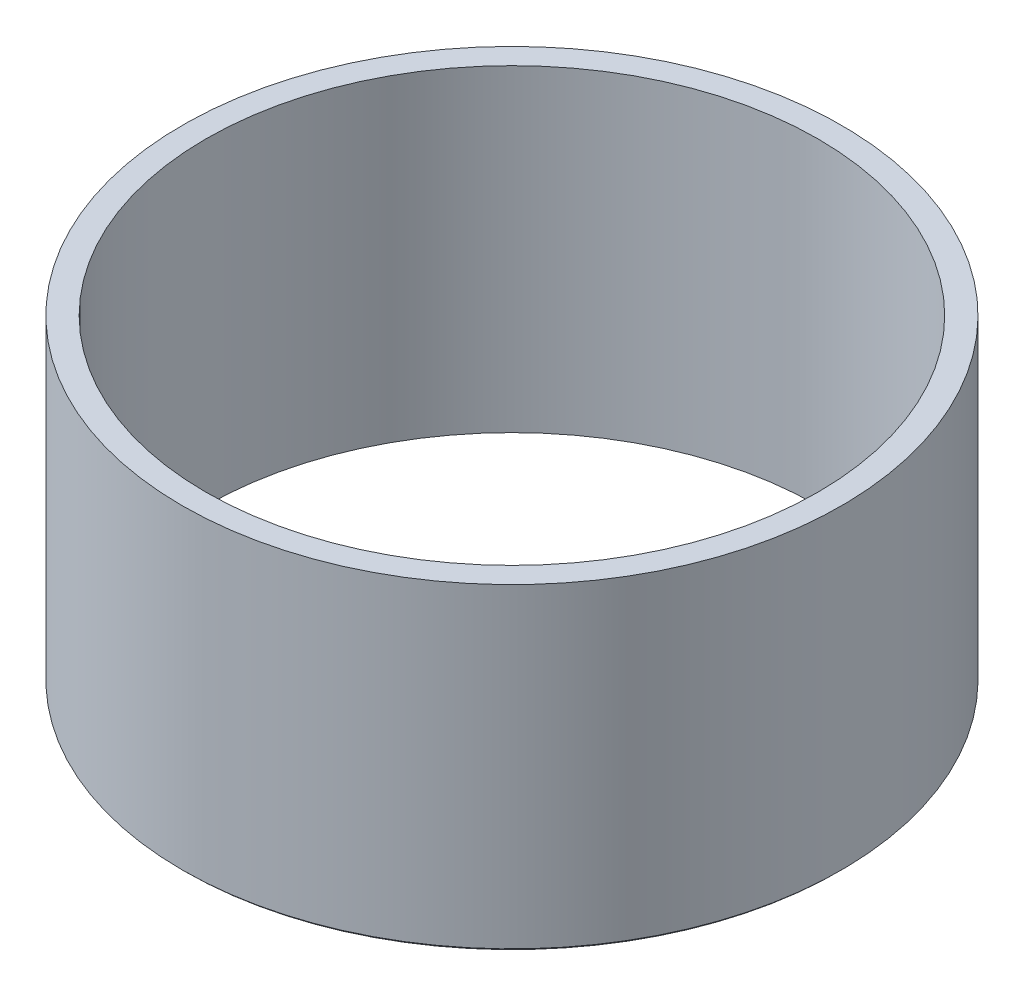
ISO-10303-21;
HEADER;
FILE_DESCRIPTION(('STEP AP214'),'2;1');
FILE_NAME('part.step','',(''),(''),'','','');
FILE_SCHEMA(('AUTOMOTIVE_DESIGN { 1 0 10303 214 1 1 1 1 }'));
ENDSEC;
DATA;
#1=APPLICATION_CONTEXT('core data for automotive mechanical design processes');
#2=APPLICATION_PROTOCOL_DEFINITION('international standard','automotive_design',2000,#1);
#3=PRODUCT_CONTEXT('',#1,'mechanical');
#4=PRODUCT('Part','Part','',(#3));
#5=PRODUCT_RELATED_PRODUCT_CATEGORY('part','',(#4));
#6=PRODUCT_DEFINITION_FORMATION('','',#4);
#7=PRODUCT_DEFINITION_CONTEXT('part definition',#1,'design');
#8=PRODUCT_DEFINITION('design','',#6,#7);
#9=PRODUCT_DEFINITION_SHAPE('','',#8);
#10=(LENGTH_UNIT() NAMED_UNIT(*) SI_UNIT(.MILLI.,.METRE.));
#11=(NAMED_UNIT(*) PLANE_ANGLE_UNIT() SI_UNIT($,.RADIAN.));
#12=(NAMED_UNIT(*) SI_UNIT($,.STERADIAN.) SOLID_ANGLE_UNIT());
#13=UNCERTAINTY_MEASURE_WITH_UNIT(LENGTH_MEASURE(1.E-05),#10,'distance_accuracy_value','');
#14=(GEOMETRIC_REPRESENTATION_CONTEXT(3) GLOBAL_UNCERTAINTY_ASSIGNED_CONTEXT((#13)) GLOBAL_UNIT_ASSIGNED_CONTEXT((#10,
#11,#12)) REPRESENTATION_CONTEXT('',''));
#15=CARTESIAN_POINT('',(0.,0.,0.));
#16=DIRECTION('',(0.,0.,1.));
#17=DIRECTION('',(1.,0.,0.));
#18=AXIS2_PLACEMENT_3D('',#15,#16,#17);
#19=CARTESIAN_POINT('',(0.,13.5,0.));
#20=DIRECTION('',(0.,1.,0.));
#21=DIRECTION('',(0.,0.,1.));
#22=AXIS2_PLACEMENT_3D('',#19,#20,#21);
#23=PLANE('',#22);
#24=CARTESIAN_POINT('',(0.,13.5,0.));
#25=DIRECTION('',(0.,1.,0.));
#26=DIRECTION('',(0.,0.,1.));
#27=AXIS2_PLACEMENT_3D('',#24,#25,#26);
#28=CIRCLE('',#27,14.);
#29=CARTESIAN_POINT('',(0.,13.5,14.));
#30=VERTEX_POINT('',#29);
#31=EDGE_CURVE('E46',#30,#30,#28,.T.);
#32=ORIENTED_EDGE('',*,*,#31,.T.);
#33=EDGE_LOOP('',(#32));
#34=FACE_BOUND('',#33,.T.);
#35=CARTESIAN_POINT('',(0.,13.5,0.));
#36=DIRECTION('',(0.,1.,0.));
#37=DIRECTION('',(0.,0.,1.));
#38=AXIS2_PLACEMENT_3D('',#35,#36,#37);
#39=CIRCLE('',#38,13.);
#40=CARTESIAN_POINT('',(0.,13.5,13.));
#41=VERTEX_POINT('',#40);
#42=EDGE_CURVE('E50',#41,#41,#39,.T.);
#43=ORIENTED_EDGE('',*,*,#42,.F.);
#44=EDGE_LOOP('',(#43));
#45=FACE_BOUND('',#44,.T.);
#46=ADVANCED_FACE('F35',(#34,#45),#23,.T.);
#47=CARTESIAN_POINT('',(0.,0.,0.));
#48=DIRECTION('',(0.,1.,0.));
#49=DIRECTION('',(0.,0.,1.));
#50=AXIS2_PLACEMENT_3D('',#47,#48,#49);
#51=PLANE('',#50);
#52=CARTESIAN_POINT('',(0.,0.,0.));
#53=DIRECTION('',(0.,1.,0.));
#54=DIRECTION('',(0.,0.,1.));
#55=AXIS2_PLACEMENT_3D('',#52,#53,#54);
#56=CIRCLE('',#55,13.9);
#57=CARTESIAN_POINT('',(0.,0.,13.9));
#58=VERTEX_POINT('',#57);
#59=EDGE_CURVE('E10',#58,#58,#56,.F.);
#60=ORIENTED_EDGE('',*,*,#59,.T.);
#61=EDGE_LOOP('',(#60));
#62=FACE_BOUND('',#61,.T.);
#63=CARTESIAN_POINT('',(0.,0.,0.));
#64=DIRECTION('',(0.,1.,0.));
#65=DIRECTION('',(0.,0.,1.));
#66=AXIS2_PLACEMENT_3D('',#63,#64,#65);
#67=CIRCLE('',#66,13.);
#68=CARTESIAN_POINT('',(0.,0.,13.));
#69=VERTEX_POINT('',#68);
#70=EDGE_CURVE('E53',#69,#69,#67,.T.);
#71=ORIENTED_EDGE('',*,*,#70,.T.);
#72=EDGE_LOOP('',(#71));
#73=FACE_BOUND('',#72,.T.);
#74=ADVANCED_FACE('F63',(#62,#73),#51,.F.);
#75=CARTESIAN_POINT('',(0.,13.5,0.));
#76=DIRECTION('',(0.,-1.,0.));
#77=DIRECTION('',(0.,0.,-1.));
#78=AXIS2_PLACEMENT_3D('',#75,#76,#77);
#79=CYLINDRICAL_SURFACE('',#78,14.);
#80=CARTESIAN_POINT('',(0.,0.0999999999999977,0.));
#81=DIRECTION('',(0.,1.,0.));
#82=DIRECTION('',(0.,0.,1.));
#83=AXIS2_PLACEMENT_3D('',#80,#81,#82);
#84=CIRCLE('',#83,14.);
#85=CARTESIAN_POINT('',(0.,0.0999999999999977,14.));
#86=VERTEX_POINT('',#85);
#87=EDGE_CURVE('E42',#86,#86,#84,.T.);
#88=ORIENTED_EDGE('',*,*,#87,.T.);
#89=EDGE_LOOP('',(#88));
#90=FACE_BOUND('',#89,.T.);
#91=ORIENTED_EDGE('',*,*,#31,.F.);
#92=EDGE_LOOP('',(#91));
#93=FACE_BOUND('',#92,.T.);
#94=ADVANCED_FACE('F69',(#90,#93),#79,.T.);
#95=CARTESIAN_POINT('',(0.,13.5,0.));
#96=DIRECTION('',(0.,-1.,0.));
#97=DIRECTION('',(0.,0.,-1.));
#98=AXIS2_PLACEMENT_3D('',#95,#96,#97);
#99=CYLINDRICAL_SURFACE('',#98,13.);
#100=ORIENTED_EDGE('',*,*,#42,.T.);
#101=EDGE_LOOP('',(#100));
#102=FACE_BOUND('',#101,.T.);
#103=ORIENTED_EDGE('',*,*,#70,.F.);
#104=EDGE_LOOP('',(#103));
#105=FACE_BOUND('',#104,.T.);
#106=ADVANCED_FACE('F59',(#102,#105),#99,.F.);
#107=CARTESIAN_POINT('',(0.,0.0999999999999977,0.));
#108=DIRECTION('',(0.,1.,0.));
#109=DIRECTION('',(0.,0.,1.));
#110=AXIS2_PLACEMENT_3D('',#107,#108,#109);
#111=CONICAL_SURFACE('',#110,14.,0.785398163397466);
#112=ORIENTED_EDGE('',*,*,#59,.F.);
#113=EDGE_LOOP('',(#112));
#114=FACE_BOUND('',#113,.T.);
#115=ORIENTED_EDGE('',*,*,#87,.F.);
#116=EDGE_LOOP('',(#115));
#117=FACE_BOUND('',#116,.T.);
#118=ADVANCED_FACE('F37',(#114,#117),#111,.T.);
#119=CLOSED_SHELL('',(#46,#74,#94,#106,#118));
#120=MANIFOLD_SOLID_BREP('B2',#119);
#121=ADVANCED_BREP_SHAPE_REPRESENTATION('',(#18,#120),#14);
#122=SHAPE_DEFINITION_REPRESENTATION(#9,#121);
ENDSEC;
END-ISO-10303-21;
